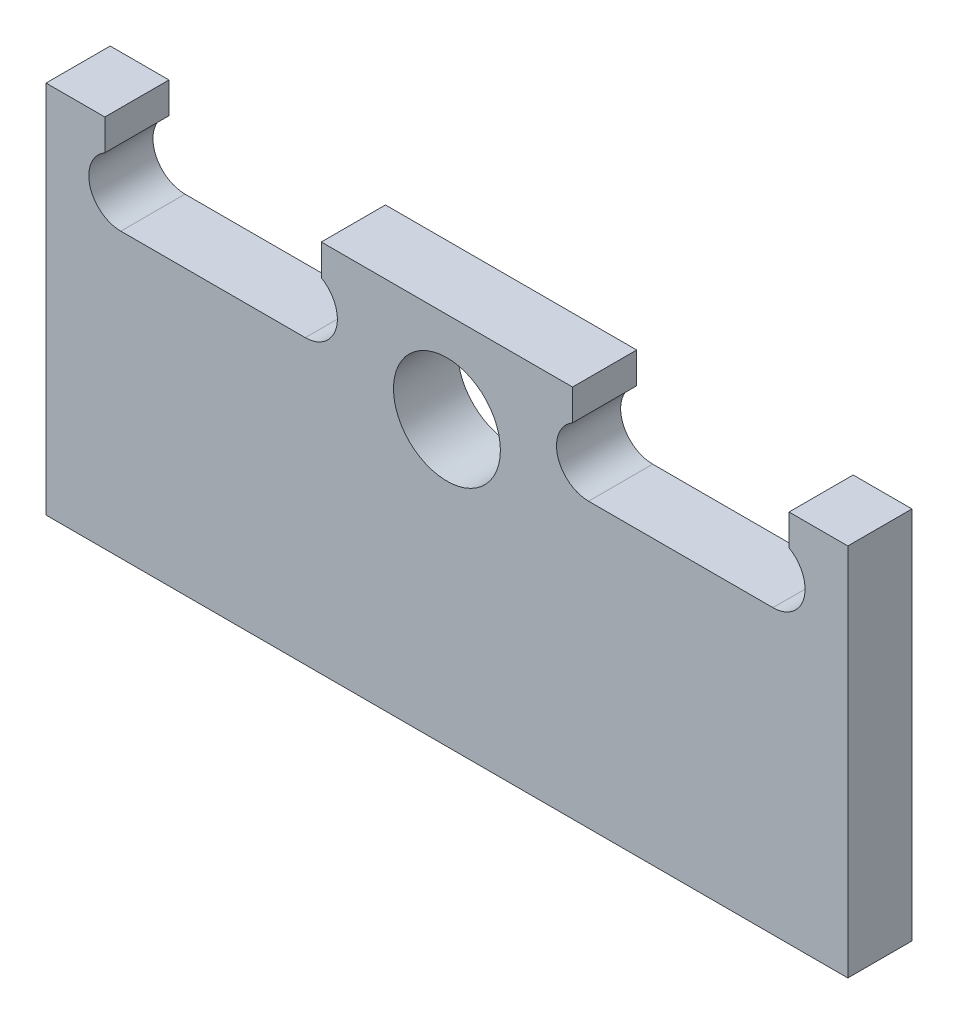
ISO-10303-21;
HEADER;
FILE_DESCRIPTION(('STEP AP214'),'2;1');
FILE_NAME('part.step','',(''),(''),'','','');
FILE_SCHEMA(('AUTOMOTIVE_DESIGN { 1 0 10303 214 1 1 1 1 }'));
ENDSEC;
DATA;
#1=APPLICATION_CONTEXT('core data for automotive mechanical design processes');
#2=APPLICATION_PROTOCOL_DEFINITION('international standard','automotive_design',2000,#1);
#3=PRODUCT_CONTEXT('',#1,'mechanical');
#4=PRODUCT('Part','Part','',(#3));
#5=PRODUCT_RELATED_PRODUCT_CATEGORY('part','',(#4));
#6=PRODUCT_DEFINITION_FORMATION('','',#4);
#7=PRODUCT_DEFINITION_CONTEXT('part definition',#1,'design');
#8=PRODUCT_DEFINITION('design','',#6,#7);
#9=PRODUCT_DEFINITION_SHAPE('','',#8);
#10=(LENGTH_UNIT() NAMED_UNIT(*) SI_UNIT(.MILLI.,.METRE.));
#11=(NAMED_UNIT(*) PLANE_ANGLE_UNIT() SI_UNIT($,.RADIAN.));
#12=(NAMED_UNIT(*) SI_UNIT($,.STERADIAN.) SOLID_ANGLE_UNIT());
#13=UNCERTAINTY_MEASURE_WITH_UNIT(LENGTH_MEASURE(1.E-05),#10,'distance_accuracy_value','');
#14=(GEOMETRIC_REPRESENTATION_CONTEXT(3) GLOBAL_UNCERTAINTY_ASSIGNED_CONTEXT((#13)) GLOBAL_UNIT_ASSIGNED_CONTEXT((#10,
#11,#12)) REPRESENTATION_CONTEXT('',''));
#15=CARTESIAN_POINT('',(0.,0.,0.));
#16=DIRECTION('',(0.,0.,1.));
#17=DIRECTION('',(1.,0.,0.));
#18=AXIS2_PLACEMENT_3D('',#15,#16,#17);
#19=CARTESIAN_POINT('',(14.,59.,12.));
#20=DIRECTION('',(0.,0.,1.));
#21=DIRECTION('',(1.,0.,0.));
#22=AXIS2_PLACEMENT_3D('',#19,#20,#21);
#23=PLANE('',#22);
#24=DIRECTION('',(1.,0.,0.));
#25=VECTOR('',#24,1.);
#26=CARTESIAN_POINT('',(150.,0.,12.));
#27=LINE('',#26,#25);
#28=CARTESIAN_POINT('',(0.,0.,12.));
#29=VERTEX_POINT('',#28);
#30=CARTESIAN_POINT('',(150.,0.,12.));
#31=VERTEX_POINT('',#30);
#32=EDGE_CURVE('E236',#29,#31,#27,.T.);
#33=ORIENTED_EDGE('',*,*,#32,.T.);
#34=DIRECTION('',(0.,1.,0.));
#35=VECTOR('',#34,1.);
#36=CARTESIAN_POINT('',(150.,70.,12.));
#37=LINE('',#36,#35);
#38=CARTESIAN_POINT('',(150.,70.,12.));
#39=VERTEX_POINT('',#38);
#40=EDGE_CURVE('E124',#31,#39,#37,.T.);
#41=ORIENTED_EDGE('',*,*,#40,.T.);
#42=DIRECTION('',(-1.,0.,0.));
#43=VECTOR('',#42,1.);
#44=CARTESIAN_POINT('',(139.,70.,12.));
#45=LINE('',#44,#43);
#46=CARTESIAN_POINT('',(139.,70.,12.));
#47=VERTEX_POINT('',#46);
#48=EDGE_CURVE('E289',#39,#47,#45,.T.);
#49=ORIENTED_EDGE('',*,*,#48,.T.);
#50=DIRECTION('',(0.,-1.,0.));
#51=VECTOR('',#50,1.);
#52=CARTESIAN_POINT('',(139.,70.,12.));
#53=LINE('',#52,#51);
#54=CARTESIAN_POINT('',(139.,64.1961524227066,12.));
#55=VERTEX_POINT('',#54);
#56=EDGE_CURVE('E309',#47,#55,#53,.T.);
#57=ORIENTED_EDGE('',*,*,#56,.T.);
#58=CARTESIAN_POINT('',(136.,59.,12.));
#59=DIRECTION('',(0.,0.,-1.));
#60=DIRECTION('',(-1.,0.,0.));
#61=AXIS2_PLACEMENT_3D('',#58,#59,#60);
#62=CIRCLE('',#61,6.);
#63=CARTESIAN_POINT('',(136.,53.,12.));
#64=VERTEX_POINT('',#63);
#65=EDGE_CURVE('E305',#55,#64,#62,.T.);
#66=ORIENTED_EDGE('',*,*,#65,.T.);
#67=DIRECTION('',(-1.,0.,0.));
#68=VECTOR('',#67,1.);
#69=CARTESIAN_POINT('',(101.5,53.,12.));
#70=LINE('',#69,#68);
#71=CARTESIAN_POINT('',(101.5,53.,12.));
#72=VERTEX_POINT('',#71);
#73=EDGE_CURVE('E308',#64,#72,#70,.T.);
#74=ORIENTED_EDGE('',*,*,#73,.T.);
#75=CARTESIAN_POINT('',(101.5,59.,12.));
#76=DIRECTION('',(0.,0.,-1.));
#77=DIRECTION('',(-1.,0.,0.));
#78=AXIS2_PLACEMENT_3D('',#75,#76,#77);
#79=CIRCLE('',#78,5.99999999999999);
#80=CARTESIAN_POINT('',(98.4999999999999,64.1961524227066,12.));
#81=VERTEX_POINT('',#80);
#82=EDGE_CURVE('E313',#72,#81,#79,.T.);
#83=ORIENTED_EDGE('',*,*,#82,.T.);
#84=DIRECTION('',(0.,1.,0.));
#85=VECTOR('',#84,1.);
#86=CARTESIAN_POINT('',(98.5,70.,12.));
#87=LINE('',#86,#85);
#88=CARTESIAN_POINT('',(98.5,70.,12.));
#89=VERTEX_POINT('',#88);
#90=EDGE_CURVE('E320',#81,#89,#87,.T.);
#91=ORIENTED_EDGE('',*,*,#90,.T.);
#92=DIRECTION('',(-1.,0.,0.));
#93=VECTOR('',#92,1.);
#94=CARTESIAN_POINT('',(51.5,70.,12.));
#95=LINE('',#94,#93);
#96=CARTESIAN_POINT('',(51.5,70.,12.));
#97=VERTEX_POINT('',#96);
#98=EDGE_CURVE('E323',#89,#97,#95,.T.);
#99=ORIENTED_EDGE('',*,*,#98,.T.);
#100=DIRECTION('',(0.,-1.,0.));
#101=VECTOR('',#100,1.);
#102=CARTESIAN_POINT('',(51.5,70.,12.));
#103=LINE('',#102,#101);
#104=CARTESIAN_POINT('',(51.5,64.1961524227067,12.));
#105=VERTEX_POINT('',#104);
#106=EDGE_CURVE('E326',#97,#105,#103,.T.);
#107=ORIENTED_EDGE('',*,*,#106,.T.);
#108=CARTESIAN_POINT('',(48.5,59.,12.));
#109=DIRECTION('',(0.,0.,-1.));
#110=DIRECTION('',(1.,0.,0.));
#111=AXIS2_PLACEMENT_3D('',#108,#109,#110);
#112=CIRCLE('',#111,6.00000000000001);
#113=CARTESIAN_POINT('',(48.5,53.,12.));
#114=VERTEX_POINT('',#113);
#115=EDGE_CURVE('E329',#105,#114,#112,.T.);
#116=ORIENTED_EDGE('',*,*,#115,.T.);
#117=DIRECTION('',(-1.,0.,0.));
#118=VECTOR('',#117,1.);
#119=CARTESIAN_POINT('',(48.5,53.,12.));
#120=LINE('',#119,#118);
#121=CARTESIAN_POINT('',(14.,53.,12.));
#122=VERTEX_POINT('',#121);
#123=EDGE_CURVE('E332',#114,#122,#120,.T.);
#124=ORIENTED_EDGE('',*,*,#123,.T.);
#125=CARTESIAN_POINT('',(14.,59.,12.));
#126=DIRECTION('',(0.,0.,-1.));
#127=DIRECTION('',(1.,0.,0.));
#128=AXIS2_PLACEMENT_3D('',#125,#126,#127);
#129=CIRCLE('',#128,6.);
#130=CARTESIAN_POINT('',(11.,64.1961524227066,12.));
#131=VERTEX_POINT('',#130);
#132=EDGE_CURVE('E167',#122,#131,#129,.T.);
#133=ORIENTED_EDGE('',*,*,#132,.T.);
#134=DIRECTION('',(0.,1.,0.));
#135=VECTOR('',#134,1.);
#136=CARTESIAN_POINT('',(11.,70.,12.));
#137=LINE('',#136,#135);
#138=CARTESIAN_POINT('',(11.,70.,12.));
#139=VERTEX_POINT('',#138);
#140=EDGE_CURVE('E161',#131,#139,#137,.T.);
#141=ORIENTED_EDGE('',*,*,#140,.T.);
#142=DIRECTION('',(-1.,0.,0.));
#143=VECTOR('',#142,1.);
#144=CARTESIAN_POINT('',(0.,70.,12.));
#145=LINE('',#144,#143);
#146=CARTESIAN_POINT('',(0.,70.,12.));
#147=VERTEX_POINT('',#146);
#148=EDGE_CURVE('E165',#139,#147,#145,.T.);
#149=ORIENTED_EDGE('',*,*,#148,.T.);
#150=DIRECTION('',(0.,-1.,0.));
#151=VECTOR('',#150,1.);
#152=CARTESIAN_POINT('',(0.,0.,12.));
#153=LINE('',#152,#151);
#154=EDGE_CURVE('E57',#147,#29,#153,.T.);
#155=ORIENTED_EDGE('',*,*,#154,.T.);
#156=EDGE_LOOP('',(#33,#41,#49,#57,#66,#74,#83,#91,#99,#107,#116,#124,#133,#141,#149,#155));
#157=FACE_BOUND('',#156,.T.);
#158=CARTESIAN_POINT('',(75.,53.,12.));
#159=DIRECTION('',(0.,0.,1.));
#160=DIRECTION('',(1.,0.,0.));
#161=AXIS2_PLACEMENT_3D('',#158,#159,#160);
#162=CIRCLE('',#161,9.99999999999999);
#163=CARTESIAN_POINT('',(85.,53.,12.));
#164=VERTEX_POINT('',#163);
#165=EDGE_CURVE('E194',#164,#164,#162,.T.);
#166=ORIENTED_EDGE('',*,*,#165,.F.);
#167=EDGE_LOOP('',(#166));
#168=FACE_BOUND('',#167,.T.);
#169=ADVANCED_FACE('F39',(#157,#168),#23,.T.);
#170=CARTESIAN_POINT('',(14.,59.,0.));
#171=DIRECTION('',(0.,0.,1.));
#172=DIRECTION('',(1.,0.,0.));
#173=AXIS2_PLACEMENT_3D('',#170,#171,#172);
#174=PLANE('',#173);
#175=DIRECTION('',(1.,0.,0.));
#176=VECTOR('',#175,1.);
#177=CARTESIAN_POINT('',(150.,0.,0.));
#178=LINE('',#177,#176);
#179=CARTESIAN_POINT('',(0.,0.,0.));
#180=VERTEX_POINT('',#179);
#181=CARTESIAN_POINT('',(150.,0.,0.));
#182=VERTEX_POINT('',#181);
#183=EDGE_CURVE('E189',#180,#182,#178,.T.);
#184=ORIENTED_EDGE('',*,*,#183,.F.);
#185=DIRECTION('',(0.,-1.,0.));
#186=VECTOR('',#185,1.);
#187=CARTESIAN_POINT('',(0.,0.,0.));
#188=LINE('',#187,#186);
#189=CARTESIAN_POINT('',(0.,70.,0.));
#190=VERTEX_POINT('',#189);
#191=EDGE_CURVE('E116',#190,#180,#188,.T.);
#192=ORIENTED_EDGE('',*,*,#191,.F.);
#193=DIRECTION('',(-1.,0.,0.));
#194=VECTOR('',#193,1.);
#195=CARTESIAN_POINT('',(0.,70.,0.));
#196=LINE('',#195,#194);
#197=CARTESIAN_POINT('',(11.,70.,0.));
#198=VERTEX_POINT('',#197);
#199=EDGE_CURVE('E110',#198,#190,#196,.T.);
#200=ORIENTED_EDGE('',*,*,#199,.F.);
#201=DIRECTION('',(0.,1.,0.));
#202=VECTOR('',#201,1.);
#203=CARTESIAN_POINT('',(11.,70.,0.));
#204=LINE('',#203,#202);
#205=CARTESIAN_POINT('',(11.,64.1961524227066,0.));
#206=VERTEX_POINT('',#205);
#207=EDGE_CURVE('E176',#206,#198,#204,.T.);
#208=ORIENTED_EDGE('',*,*,#207,.F.);
#209=CARTESIAN_POINT('',(14.,59.,0.));
#210=DIRECTION('',(0.,0.,-1.));
#211=DIRECTION('',(1.,0.,0.));
#212=AXIS2_PLACEMENT_3D('',#209,#210,#211);
#213=CIRCLE('',#212,6.);
#214=CARTESIAN_POINT('',(14.,53.,0.));
#215=VERTEX_POINT('',#214);
#216=EDGE_CURVE('E227',#215,#206,#213,.T.);
#217=ORIENTED_EDGE('',*,*,#216,.F.);
#218=DIRECTION('',(-1.,0.,0.));
#219=VECTOR('',#218,1.);
#220=CARTESIAN_POINT('',(48.5,53.,0.));
#221=LINE('',#220,#219);
#222=CARTESIAN_POINT('',(48.5,53.,0.));
#223=VERTEX_POINT('',#222);
#224=EDGE_CURVE('E224',#223,#215,#221,.T.);
#225=ORIENTED_EDGE('',*,*,#224,.F.);
#226=CARTESIAN_POINT('',(48.5,59.,0.));
#227=DIRECTION('',(0.,0.,-1.));
#228=DIRECTION('',(1.,0.,0.));
#229=AXIS2_PLACEMENT_3D('',#226,#227,#228);
#230=CIRCLE('',#229,6.00000000000001);
#231=CARTESIAN_POINT('',(51.5,64.1961524227067,0.));
#232=VERTEX_POINT('',#231);
#233=EDGE_CURVE('E221',#232,#223,#230,.T.);
#234=ORIENTED_EDGE('',*,*,#233,.F.);
#235=DIRECTION('',(0.,-1.,0.));
#236=VECTOR('',#235,1.);
#237=CARTESIAN_POINT('',(51.5,70.,0.));
#238=LINE('',#237,#236);
#239=CARTESIAN_POINT('',(51.5,70.,0.));
#240=VERTEX_POINT('',#239);
#241=EDGE_CURVE('E218',#240,#232,#238,.T.);
#242=ORIENTED_EDGE('',*,*,#241,.F.);
#243=DIRECTION('',(-1.,0.,0.));
#244=VECTOR('',#243,1.);
#245=CARTESIAN_POINT('',(51.5,70.,0.));
#246=LINE('',#245,#244);
#247=CARTESIAN_POINT('',(98.5,70.,0.));
#248=VERTEX_POINT('',#247);
#249=EDGE_CURVE('E215',#248,#240,#246,.T.);
#250=ORIENTED_EDGE('',*,*,#249,.F.);
#251=DIRECTION('',(0.,1.,0.));
#252=VECTOR('',#251,1.);
#253=CARTESIAN_POINT('',(98.5,70.,0.));
#254=LINE('',#253,#252);
#255=CARTESIAN_POINT('',(98.4999999999999,64.1961524227066,0.));
#256=VERTEX_POINT('',#255);
#257=EDGE_CURVE('E212',#256,#248,#254,.T.);
#258=ORIENTED_EDGE('',*,*,#257,.F.);
#259=CARTESIAN_POINT('',(101.5,59.,0.));
#260=DIRECTION('',(0.,0.,-1.));
#261=DIRECTION('',(-1.,0.,0.));
#262=AXIS2_PLACEMENT_3D('',#259,#260,#261);
#263=CIRCLE('',#262,5.99999999999999);
#264=CARTESIAN_POINT('',(101.5,53.,0.));
#265=VERTEX_POINT('',#264);
#266=EDGE_CURVE('E209',#265,#256,#263,.T.);
#267=ORIENTED_EDGE('',*,*,#266,.F.);
#268=DIRECTION('',(-1.,0.,0.));
#269=VECTOR('',#268,1.);
#270=CARTESIAN_POINT('',(101.5,53.,0.));
#271=LINE('',#270,#269);
#272=CARTESIAN_POINT('',(136.,53.,0.));
#273=VERTEX_POINT('',#272);
#274=EDGE_CURVE('E206',#273,#265,#271,.T.);
#275=ORIENTED_EDGE('',*,*,#274,.F.);
#276=CARTESIAN_POINT('',(136.,59.,0.));
#277=DIRECTION('',(0.,0.,-1.));
#278=DIRECTION('',(-1.,0.,0.));
#279=AXIS2_PLACEMENT_3D('',#276,#277,#278);
#280=CIRCLE('',#279,6.);
#281=CARTESIAN_POINT('',(139.,64.1961524227066,0.));
#282=VERTEX_POINT('',#281);
#283=EDGE_CURVE('E203',#282,#273,#280,.T.);
#284=ORIENTED_EDGE('',*,*,#283,.F.);
#285=DIRECTION('',(0.,-1.,0.));
#286=VECTOR('',#285,1.);
#287=CARTESIAN_POINT('',(139.,70.,0.));
#288=LINE('',#287,#286);
#289=CARTESIAN_POINT('',(139.,70.,0.));
#290=VERTEX_POINT('',#289);
#291=EDGE_CURVE('E200',#290,#282,#288,.T.);
#292=ORIENTED_EDGE('',*,*,#291,.F.);
#293=DIRECTION('',(-1.,0.,0.));
#294=VECTOR('',#293,1.);
#295=CARTESIAN_POINT('',(139.,70.,0.));
#296=LINE('',#295,#294);
#297=CARTESIAN_POINT('',(150.,70.,0.));
#298=VERTEX_POINT('',#297);
#299=EDGE_CURVE('E197',#298,#290,#296,.T.);
#300=ORIENTED_EDGE('',*,*,#299,.F.);
#301=DIRECTION('',(0.,1.,0.));
#302=VECTOR('',#301,1.);
#303=CARTESIAN_POINT('',(150.,70.,0.));
#304=LINE('',#303,#302);
#305=EDGE_CURVE('E193',#182,#298,#304,.T.);
#306=ORIENTED_EDGE('',*,*,#305,.F.);
#307=EDGE_LOOP('',(#184,#192,#200,#208,#217,#225,#234,#242,#250,#258,#267,#275,#284,#292,#300,#306));
#308=FACE_BOUND('',#307,.T.);
#309=CARTESIAN_POINT('',(75.,53.,0.));
#310=DIRECTION('',(0.,0.,1.));
#311=DIRECTION('',(1.,0.,0.));
#312=AXIS2_PLACEMENT_3D('',#309,#310,#311);
#313=CIRCLE('',#312,9.99999999999999);
#314=CARTESIAN_POINT('',(85.,53.,0.));
#315=VERTEX_POINT('',#314);
#316=EDGE_CURVE('E533',#315,#315,#313,.T.);
#317=ORIENTED_EDGE('',*,*,#316,.T.);
#318=EDGE_LOOP('',(#317));
#319=FACE_BOUND('',#318,.T.);
#320=ADVANCED_FACE('F293',(#308,#319),#174,.F.);
#321=CARTESIAN_POINT('',(150.,0.,12.));
#322=DIRECTION('',(0.,1.,0.));
#323=DIRECTION('',(-1.,0.,0.));
#324=AXIS2_PLACEMENT_3D('',#321,#322,#323);
#325=PLANE('',#324);
#326=ORIENTED_EDGE('',*,*,#183,.T.);
#327=DIRECTION('',(0.,0.,-1.));
#328=VECTOR('',#327,1.);
#329=CARTESIAN_POINT('',(150.,0.,12.));
#330=LINE('',#329,#328);
#331=EDGE_CURVE('E11',#31,#182,#330,.T.);
#332=ORIENTED_EDGE('',*,*,#331,.F.);
#333=ORIENTED_EDGE('',*,*,#32,.F.);
#334=DIRECTION('',(0.,0.,-1.));
#335=VECTOR('',#334,1.);
#336=CARTESIAN_POINT('',(0.,0.,12.));
#337=LINE('',#336,#335);
#338=EDGE_CURVE('E185',#29,#180,#337,.T.);
#339=ORIENTED_EDGE('',*,*,#338,.T.);
#340=EDGE_LOOP('',(#326,#332,#333,#339));
#341=FACE_BOUND('',#340,.T.);
#342=ADVANCED_FACE('F41',(#341),#325,.F.);
#343=CARTESIAN_POINT('',(150.,70.,12.));
#344=DIRECTION('',(-1.,0.,0.));
#345=DIRECTION('',(0.,-1.,0.));
#346=AXIS2_PLACEMENT_3D('',#343,#344,#345);
#347=PLANE('',#346);
#348=ORIENTED_EDGE('',*,*,#305,.T.);
#349=DIRECTION('',(0.,0.,-1.));
#350=VECTOR('',#349,1.);
#351=CARTESIAN_POINT('',(150.,70.,12.));
#352=LINE('',#351,#350);
#353=EDGE_CURVE('E49',#39,#298,#352,.T.);
#354=ORIENTED_EDGE('',*,*,#353,.F.);
#355=ORIENTED_EDGE('',*,*,#40,.F.);
#356=ORIENTED_EDGE('',*,*,#331,.T.);
#357=EDGE_LOOP('',(#348,#354,#355,#356));
#358=FACE_BOUND('',#357,.T.);
#359=ADVANCED_FACE('F368',(#358),#347,.F.);
#360=CARTESIAN_POINT('',(139.,70.,12.));
#361=DIRECTION('',(0.,-1.,0.));
#362=DIRECTION('',(0.,0.,-1.));
#363=AXIS2_PLACEMENT_3D('',#360,#361,#362);
#364=PLANE('',#363);
#365=ORIENTED_EDGE('',*,*,#299,.T.);
#366=DIRECTION('',(0.,0.,-1.));
#367=VECTOR('',#366,1.);
#368=CARTESIAN_POINT('',(139.,70.,12.));
#369=LINE('',#368,#367);
#370=EDGE_CURVE('E279',#47,#290,#369,.T.);
#371=ORIENTED_EDGE('',*,*,#370,.F.);
#372=ORIENTED_EDGE('',*,*,#48,.F.);
#373=ORIENTED_EDGE('',*,*,#353,.T.);
#374=EDGE_LOOP('',(#365,#371,#372,#373));
#375=FACE_BOUND('',#374,.T.);
#376=ADVANCED_FACE('F287',(#375),#364,.F.);
#377=CARTESIAN_POINT('',(139.,70.,12.));
#378=DIRECTION('',(1.,0.,0.));
#379=DIRECTION('',(0.,0.,-1.));
#380=AXIS2_PLACEMENT_3D('',#377,#378,#379);
#381=PLANE('',#380);
#382=ORIENTED_EDGE('',*,*,#291,.T.);
#383=DIRECTION('',(0.,0.,-1.));
#384=VECTOR('',#383,1.);
#385=CARTESIAN_POINT('',(139.,64.1961524227066,12.));
#386=LINE('',#385,#384);
#387=EDGE_CURVE('E275',#55,#282,#386,.T.);
#388=ORIENTED_EDGE('',*,*,#387,.F.);
#389=ORIENTED_EDGE('',*,*,#56,.F.);
#390=ORIENTED_EDGE('',*,*,#370,.T.);
#391=EDGE_LOOP('',(#382,#388,#389,#390));
#392=FACE_BOUND('',#391,.T.);
#393=ADVANCED_FACE('F299',(#392),#381,.F.);
#394=CARTESIAN_POINT('',(136.,59.,12.));
#395=DIRECTION('',(0.,0.,-1.));
#396=DIRECTION('',(-1.,0.,0.));
#397=AXIS2_PLACEMENT_3D('',#394,#395,#396);
#398=CYLINDRICAL_SURFACE('',#397,6.);
#399=ORIENTED_EDGE('',*,*,#283,.T.);
#400=DIRECTION('',(0.,0.,-1.));
#401=VECTOR('',#400,1.);
#402=CARTESIAN_POINT('',(136.,53.,12.));
#403=LINE('',#402,#401);
#404=EDGE_CURVE('E271',#64,#273,#403,.T.);
#405=ORIENTED_EDGE('',*,*,#404,.F.);
#406=ORIENTED_EDGE('',*,*,#65,.F.);
#407=ORIENTED_EDGE('',*,*,#387,.T.);
#408=EDGE_LOOP('',(#399,#405,#406,#407));
#409=FACE_BOUND('',#408,.T.);
#410=ADVANCED_FACE('F303',(#409),#398,.F.);
#411=CARTESIAN_POINT('',(101.5,53.,12.));
#412=DIRECTION('',(0.,-1.,0.));
#413=DIRECTION('',(1.,0.,0.));
#414=AXIS2_PLACEMENT_3D('',#411,#412,#413);
#415=PLANE('',#414);
#416=ORIENTED_EDGE('',*,*,#274,.T.);
#417=DIRECTION('',(0.,0.,-1.));
#418=VECTOR('',#417,1.);
#419=CARTESIAN_POINT('',(101.5,53.,12.));
#420=LINE('',#419,#418);
#421=EDGE_CURVE('E267',#72,#265,#420,.T.);
#422=ORIENTED_EDGE('',*,*,#421,.F.);
#423=ORIENTED_EDGE('',*,*,#73,.F.);
#424=ORIENTED_EDGE('',*,*,#404,.T.);
#425=EDGE_LOOP('',(#416,#422,#423,#424));
#426=FACE_BOUND('',#425,.T.);
#427=ADVANCED_FACE('F381',(#426),#415,.F.);
#428=CARTESIAN_POINT('',(101.5,59.,12.));
#429=DIRECTION('',(0.,0.,-1.));
#430=DIRECTION('',(-1.,0.,0.));
#431=AXIS2_PLACEMENT_3D('',#428,#429,#430);
#432=CYLINDRICAL_SURFACE('',#431,5.99999999999999);
#433=ORIENTED_EDGE('',*,*,#266,.T.);
#434=DIRECTION('',(0.,0.,-1.));
#435=VECTOR('',#434,1.);
#436=CARTESIAN_POINT('',(98.4999999999999,64.1961524227066,12.));
#437=LINE('',#436,#435);
#438=EDGE_CURVE('E263',#81,#256,#437,.T.);
#439=ORIENTED_EDGE('',*,*,#438,.F.);
#440=ORIENTED_EDGE('',*,*,#82,.F.);
#441=ORIENTED_EDGE('',*,*,#421,.T.);
#442=EDGE_LOOP('',(#433,#439,#440,#441));
#443=FACE_BOUND('',#442,.T.);
#444=ADVANCED_FACE('F384',(#443),#432,.F.);
#445=CARTESIAN_POINT('',(98.5,70.,12.));
#446=DIRECTION('',(-1.,0.,0.));
#447=DIRECTION('',(0.,-1.,0.));
#448=AXIS2_PLACEMENT_3D('',#445,#446,#447);
#449=PLANE('',#448);
#450=ORIENTED_EDGE('',*,*,#257,.T.);
#451=DIRECTION('',(0.,0.,-1.));
#452=VECTOR('',#451,1.);
#453=CARTESIAN_POINT('',(98.5,70.,12.));
#454=LINE('',#453,#452);
#455=EDGE_CURVE('E259',#89,#248,#454,.T.);
#456=ORIENTED_EDGE('',*,*,#455,.F.);
#457=ORIENTED_EDGE('',*,*,#90,.F.);
#458=ORIENTED_EDGE('',*,*,#438,.T.);
#459=EDGE_LOOP('',(#450,#456,#457,#458));
#460=FACE_BOUND('',#459,.T.);
#461=ADVANCED_FACE('F388',(#460),#449,.F.);
#462=CARTESIAN_POINT('',(51.5,70.,12.));
#463=DIRECTION('',(0.,-1.,0.));
#464=DIRECTION('',(0.,0.,-1.));
#465=AXIS2_PLACEMENT_3D('',#462,#463,#464);
#466=PLANE('',#465);
#467=ORIENTED_EDGE('',*,*,#249,.T.);
#468=DIRECTION('',(0.,0.,-1.));
#469=VECTOR('',#468,1.);
#470=CARTESIAN_POINT('',(51.5,70.,12.));
#471=LINE('',#470,#469);
#472=EDGE_CURVE('E255',#97,#240,#471,.T.);
#473=ORIENTED_EDGE('',*,*,#472,.F.);
#474=ORIENTED_EDGE('',*,*,#98,.F.);
#475=ORIENTED_EDGE('',*,*,#455,.T.);
#476=EDGE_LOOP('',(#467,#473,#474,#475));
#477=FACE_BOUND('',#476,.T.);
#478=ADVANCED_FACE('F392',(#477),#466,.F.);
#479=CARTESIAN_POINT('',(51.5,70.,12.));
#480=DIRECTION('',(1.,0.,0.));
#481=DIRECTION('',(0.,1.,0.));
#482=AXIS2_PLACEMENT_3D('',#479,#480,#481);
#483=PLANE('',#482);
#484=ORIENTED_EDGE('',*,*,#241,.T.);
#485=DIRECTION('',(0.,0.,-1.));
#486=VECTOR('',#485,1.);
#487=CARTESIAN_POINT('',(51.5,64.1961524227067,12.));
#488=LINE('',#487,#486);
#489=EDGE_CURVE('E251',#105,#232,#488,.T.);
#490=ORIENTED_EDGE('',*,*,#489,.F.);
#491=ORIENTED_EDGE('',*,*,#106,.F.);
#492=ORIENTED_EDGE('',*,*,#472,.T.);
#493=EDGE_LOOP('',(#484,#490,#491,#492));
#494=FACE_BOUND('',#493,.T.);
#495=ADVANCED_FACE('F396',(#494),#483,.F.);
#496=CARTESIAN_POINT('',(48.5,59.,12.));
#497=DIRECTION('',(0.,0.,-1.));
#498=DIRECTION('',(-1.,0.,0.));
#499=AXIS2_PLACEMENT_3D('',#496,#497,#498);
#500=CYLINDRICAL_SURFACE('',#499,6.00000000000001);
#501=ORIENTED_EDGE('',*,*,#233,.T.);
#502=DIRECTION('',(0.,0.,-1.));
#503=VECTOR('',#502,1.);
#504=CARTESIAN_POINT('',(48.5,53.,12.));
#505=LINE('',#504,#503);
#506=EDGE_CURVE('E247',#114,#223,#505,.T.);
#507=ORIENTED_EDGE('',*,*,#506,.F.);
#508=ORIENTED_EDGE('',*,*,#115,.F.);
#509=ORIENTED_EDGE('',*,*,#489,.T.);
#510=EDGE_LOOP('',(#501,#507,#508,#509));
#511=FACE_BOUND('',#510,.T.);
#512=ADVANCED_FACE('F400',(#511),#500,.F.);
#513=CARTESIAN_POINT('',(48.5,53.,12.));
#514=DIRECTION('',(0.,-1.,0.));
#515=DIRECTION('',(1.,0.,0.));
#516=AXIS2_PLACEMENT_3D('',#513,#514,#515);
#517=PLANE('',#516);
#518=ORIENTED_EDGE('',*,*,#224,.T.);
#519=DIRECTION('',(0.,0.,-1.));
#520=VECTOR('',#519,1.);
#521=CARTESIAN_POINT('',(14.,53.,12.));
#522=LINE('',#521,#520);
#523=EDGE_CURVE('E243',#122,#215,#522,.T.);
#524=ORIENTED_EDGE('',*,*,#523,.F.);
#525=ORIENTED_EDGE('',*,*,#123,.F.);
#526=ORIENTED_EDGE('',*,*,#506,.T.);
#527=EDGE_LOOP('',(#518,#524,#525,#526));
#528=FACE_BOUND('',#527,.T.);
#529=ADVANCED_FACE('F340',(#528),#517,.F.);
#530=CARTESIAN_POINT('',(14.,59.,12.));
#531=DIRECTION('',(0.,0.,-1.));
#532=DIRECTION('',(-1.,0.,0.));
#533=AXIS2_PLACEMENT_3D('',#530,#531,#532);
#534=CYLINDRICAL_SURFACE('',#533,6.);
#535=ORIENTED_EDGE('',*,*,#216,.T.);
#536=DIRECTION('',(0.,0.,-1.));
#537=VECTOR('',#536,1.);
#538=CARTESIAN_POINT('',(11.,64.1961524227066,12.));
#539=LINE('',#538,#537);
#540=EDGE_CURVE('E178',#131,#206,#539,.T.);
#541=ORIENTED_EDGE('',*,*,#540,.F.);
#542=ORIENTED_EDGE('',*,*,#132,.F.);
#543=ORIENTED_EDGE('',*,*,#523,.T.);
#544=EDGE_LOOP('',(#535,#541,#542,#543));
#545=FACE_BOUND('',#544,.T.);
#546=ADVANCED_FACE('F344',(#545),#534,.F.);
#547=CARTESIAN_POINT('',(11.,70.,12.));
#548=DIRECTION('',(-1.,0.,0.));
#549=DIRECTION('',(0.,-1.,0.));
#550=AXIS2_PLACEMENT_3D('',#547,#548,#549);
#551=PLANE('',#550);
#552=ORIENTED_EDGE('',*,*,#207,.T.);
#553=DIRECTION('',(0.,0.,-1.));
#554=VECTOR('',#553,1.);
#555=CARTESIAN_POINT('',(11.,70.,12.));
#556=LINE('',#555,#554);
#557=EDGE_CURVE('E173',#139,#198,#556,.T.);
#558=ORIENTED_EDGE('',*,*,#557,.F.);
#559=ORIENTED_EDGE('',*,*,#140,.F.);
#560=ORIENTED_EDGE('',*,*,#540,.T.);
#561=EDGE_LOOP('',(#552,#558,#559,#560));
#562=FACE_BOUND('',#561,.T.);
#563=ADVANCED_FACE('F174',(#562),#551,.F.);
#564=CARTESIAN_POINT('',(0.,70.,12.));
#565=DIRECTION('',(0.,-1.,0.));
#566=DIRECTION('',(0.,0.,-1.));
#567=AXIS2_PLACEMENT_3D('',#564,#565,#566);
#568=PLANE('',#567);
#569=ORIENTED_EDGE('',*,*,#199,.T.);
#570=DIRECTION('',(0.,0.,-1.));
#571=VECTOR('',#570,1.);
#572=CARTESIAN_POINT('',(0.,70.,12.));
#573=LINE('',#572,#571);
#574=EDGE_CURVE('E179',#147,#190,#573,.T.);
#575=ORIENTED_EDGE('',*,*,#574,.F.);
#576=ORIENTED_EDGE('',*,*,#148,.F.);
#577=ORIENTED_EDGE('',*,*,#557,.T.);
#578=EDGE_LOOP('',(#569,#575,#576,#577));
#579=FACE_BOUND('',#578,.T.);
#580=ADVANCED_FACE('F181',(#579),#568,.F.);
#581=CARTESIAN_POINT('',(0.,0.,12.));
#582=DIRECTION('',(1.,0.,0.));
#583=DIRECTION('',(0.,0.,-1.));
#584=AXIS2_PLACEMENT_3D('',#581,#582,#583);
#585=PLANE('',#584);
#586=ORIENTED_EDGE('',*,*,#191,.T.);
#587=ORIENTED_EDGE('',*,*,#338,.F.);
#588=ORIENTED_EDGE('',*,*,#154,.F.);
#589=ORIENTED_EDGE('',*,*,#574,.T.);
#590=EDGE_LOOP('',(#586,#587,#588,#589));
#591=FACE_BOUND('',#590,.T.);
#592=ADVANCED_FACE('F348',(#591),#585,.F.);
#593=CARTESIAN_POINT('',(75.,53.,12.));
#594=DIRECTION('',(0.,0.,-1.));
#595=DIRECTION('',(-1.,0.,0.));
#596=AXIS2_PLACEMENT_3D('',#593,#594,#595);
#597=CYLINDRICAL_SURFACE('',#596,9.99999999999999);
#598=ORIENTED_EDGE('',*,*,#165,.T.);
#599=EDGE_LOOP('',(#598));
#600=FACE_BOUND('',#599,.T.);
#601=ORIENTED_EDGE('',*,*,#316,.F.);
#602=EDGE_LOOP('',(#601));
#603=FACE_BOUND('',#602,.T.);
#604=ADVANCED_FACE('F350',(#600,#603),#597,.F.);
#605=CLOSED_SHELL('',(#169,#320,#342,#359,#376,#393,#410,#427,#444,#461,#478,#495,#512,#529,
#546,#563,#580,#592,#604));
#606=MANIFOLD_SOLID_BREP('B2',#605);
#607=ADVANCED_BREP_SHAPE_REPRESENTATION('',(#18,#606),#14);
#608=SHAPE_DEFINITION_REPRESENTATION(#9,#607);
ENDSEC;
END-ISO-10303-21;
